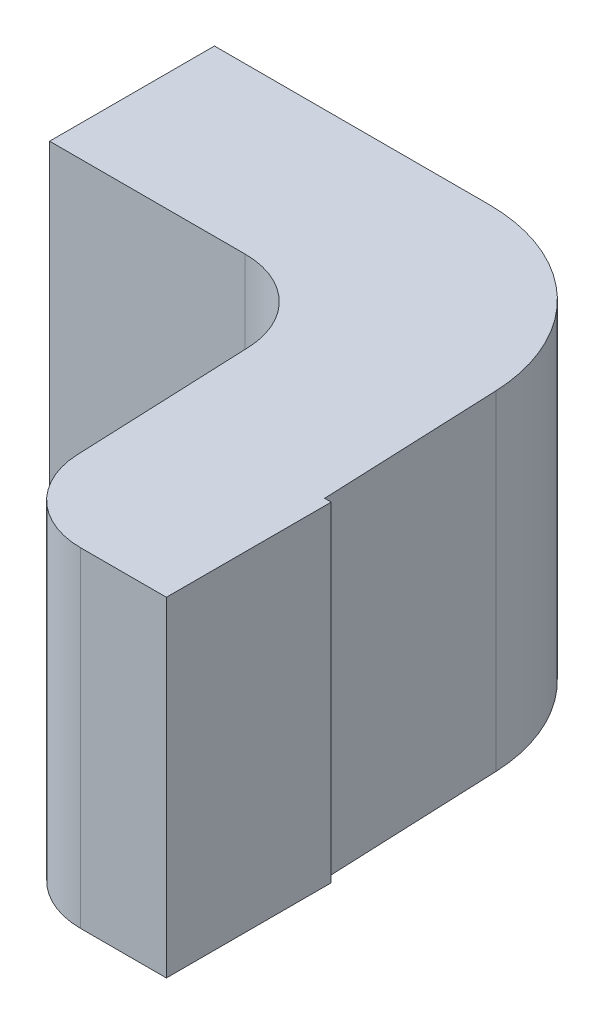
ISO-10303-21;
HEADER;
FILE_DESCRIPTION(('STEP AP214'),'2;1');
FILE_NAME('part.step','',(''),(''),'','','');
FILE_SCHEMA(('AUTOMOTIVE_DESIGN { 1 0 10303 214 1 1 1 1 }'));
ENDSEC;
DATA;
#1=APPLICATION_CONTEXT('core data for automotive mechanical design processes');
#2=APPLICATION_PROTOCOL_DEFINITION('international standard','automotive_design',2000,#1);
#3=PRODUCT_CONTEXT('',#1,'mechanical');
#4=PRODUCT('Part','Part','',(#3));
#5=PRODUCT_RELATED_PRODUCT_CATEGORY('part','',(#4));
#6=PRODUCT_DEFINITION_FORMATION('','',#4);
#7=PRODUCT_DEFINITION_CONTEXT('part definition',#1,'design');
#8=PRODUCT_DEFINITION('design','',#6,#7);
#9=PRODUCT_DEFINITION_SHAPE('','',#8);
#10=(LENGTH_UNIT() NAMED_UNIT(*) SI_UNIT(.MILLI.,.METRE.));
#11=(NAMED_UNIT(*) PLANE_ANGLE_UNIT() SI_UNIT($,.RADIAN.));
#12=(NAMED_UNIT(*) SI_UNIT($,.STERADIAN.) SOLID_ANGLE_UNIT());
#13=UNCERTAINTY_MEASURE_WITH_UNIT(LENGTH_MEASURE(1.E-05),#10,'distance_accuracy_value','');
#14=(GEOMETRIC_REPRESENTATION_CONTEXT(3) GLOBAL_UNCERTAINTY_ASSIGNED_CONTEXT((#13)) GLOBAL_UNIT_ASSIGNED_CONTEXT((#10,
#11,#12)) REPRESENTATION_CONTEXT('',''));
#15=CARTESIAN_POINT('',(0.,0.,0.));
#16=DIRECTION('',(0.,0.,1.));
#17=DIRECTION('',(1.,0.,0.));
#18=AXIS2_PLACEMENT_3D('',#15,#16,#17);
#19=CARTESIAN_POINT('',(-0.869222069455,-1.15,0.246012646141));
#20=DIRECTION('',(0.,-1.,0.));
#21=DIRECTION('',(1.,0.,0.));
#22=AXIS2_PLACEMENT_3D('',#19,#20,#21);
#23=PLANE('',#22);
#24=DIRECTION('',(1.,0.,0.));
#25=VECTOR('',#24,1.);
#26=CARTESIAN_POINT('',(-1.2,-1.15,0.2));
#27=LINE('',#26,#25);
#28=CARTESIAN_POINT('',(-1.2,-1.15,0.2));
#29=VERTEX_POINT('',#28);
#30=CARTESIAN_POINT('',(-0.962760303737,-1.15,0.2));
#31=VERTEX_POINT('',#30);
#32=EDGE_CURVE('E85',#29,#31,#27,.T.);
#33=ORIENTED_EDGE('',*,*,#32,.F.);
#34=DIRECTION('',(0.,0.,-1.));
#35=VECTOR('',#34,1.);
#36=CARTESIAN_POINT('',(-1.2,-1.15,0.));
#37=LINE('',#36,#35);
#38=CARTESIAN_POINT('',(-1.2,-1.15,0.));
#39=VERTEX_POINT('',#38);
#40=EDGE_CURVE('E91',#29,#39,#37,.T.);
#41=ORIENTED_EDGE('',*,*,#40,.T.);
#42=DIRECTION('',(1.,0.,0.));
#43=VECTOR('',#42,1.);
#44=CARTESIAN_POINT('',(-1.2,-1.15,0.));
#45=LINE('',#44,#43);
#46=CARTESIAN_POINT('',(-0.866840202491,-1.15,0.));
#47=VERTEX_POINT('',#46);
#48=EDGE_CURVE('E177',#39,#47,#45,.T.);
#49=ORIENTED_EDGE('',*,*,#48,.T.);
#50=CARTESIAN_POINT('',(-0.866840202491,-1.15,0.2));
#51=DIRECTION('',(0.,1.,0.));
#52=DIRECTION('',(0.,0.,1.));
#53=AXIS2_PLACEMENT_3D('',#50,#51,#52);
#54=CIRCLE('',#53,0.2);
#55=CARTESIAN_POINT('',(-0.667013587872555,-1.15,0.191673891057771));
#56=VERTEX_POINT('',#55);
#57=EDGE_CURVE('E203',#56,#47,#54,.T.);
#58=ORIENTED_EDGE('',*,*,#57,.F.);
#59=DIRECTION('',(-0.0416305447122046,0.,-0.999133073092351));
#60=VECTOR('',#59,1.);
#61=CARTESIAN_POINT('',(-0.675,-1.15,0.));
#62=LINE('',#61,#60);
#63=CARTESIAN_POINT('',(-0.657986412127406,-1.15,0.408326108942011));
#64=VERTEX_POINT('',#63);
#65=EDGE_CURVE('E120',#64,#56,#62,.T.);
#66=ORIENTED_EDGE('',*,*,#65,.F.);
#67=DIRECTION('',(1.,0.,0.));
#68=VECTOR('',#67,1.);
#69=CARTESIAN_POINT('',(-0.849826614618,-1.15,0.408326108942));
#70=LINE('',#69,#68);
#71=CARTESIAN_POINT('',(-0.65,-1.15,0.408326108942));
#72=VERTEX_POINT('',#71);
#73=EDGE_CURVE('E121',#64,#72,#70,.T.);
#74=ORIENTED_EDGE('',*,*,#73,.T.);
#75=DIRECTION('',(0.,0.,-1.));
#76=VECTOR('',#75,1.);
#77=CARTESIAN_POINT('',(-0.65,-1.15,0.408326108942));
#78=LINE('',#77,#76);
#79=CARTESIAN_POINT('',(-0.65,-1.15,0.608326108942));
#80=VERTEX_POINT('',#79);
#81=EDGE_CURVE('E117',#80,#72,#78,.T.);
#82=ORIENTED_EDGE('',*,*,#81,.F.);
#83=DIRECTION('',(1.,0.,0.));
#84=VECTOR('',#83,1.);
#85=CARTESIAN_POINT('',(-0.849826614618,-1.15,0.608326108942));
#86=LINE('',#85,#84);
#87=CARTESIAN_POINT('',(-0.753906513373,-1.15,0.608326108942));
#88=VERTEX_POINT('',#87);
#89=EDGE_CURVE('E150',#88,#80,#86,.T.);
#90=ORIENTED_EDGE('',*,*,#89,.F.);
#91=CARTESIAN_POINT('',(-0.753906513373,-1.15,0.508326108942));
#92=DIRECTION('',(0.,1.,0.));
#93=DIRECTION('',(0.,0.,1.));
#94=AXIS2_PLACEMENT_3D('',#91,#92,#93);
#95=CIRCLE('',#94,0.1);
#96=CARTESIAN_POINT('',(-0.853819820681954,-1.15,0.512489163413604));
#97=VERTEX_POINT('',#96);
#98=EDGE_CURVE('E154',#97,#88,#95,.T.);
#99=ORIENTED_EDGE('',*,*,#98,.F.);
#100=DIRECTION('',(-0.0416305447122046,0.,-0.999133073092351));
#101=VECTOR('',#100,1.);
#102=CARTESIAN_POINT('',(-0.874826614618,-1.15,0.008326108942436));
#103=LINE('',#102,#101);
#104=CARTESIAN_POINT('',(-0.862846996426892,-1.15,0.295836945528869));
#105=VERTEX_POINT('',#104);
#106=EDGE_CURVE('E78',#97,#105,#103,.T.);
#107=ORIENTED_EDGE('',*,*,#106,.T.);
#108=CARTESIAN_POINT('',(-0.962760303737,-1.15,0.3));
#109=DIRECTION('',(0.,1.,0.));
#110=DIRECTION('',(0.,0.,1.));
#111=AXIS2_PLACEMENT_3D('',#108,#109,#110);
#112=CIRCLE('',#111,0.1);
#113=EDGE_CURVE('E19',#105,#31,#112,.T.);
#114=ORIENTED_EDGE('',*,*,#113,.T.);
#115=EDGE_LOOP('',(#33,#41,#49,#58,#66,#74,#82,#90,#99,#107,#114));
#116=FACE_BOUND('',#115,.T.);
#117=ADVANCED_FACE('F16',(#116),#23,.T.);
#118=CARTESIAN_POINT('',(-1.2,-1.15,0.));
#119=DIRECTION('',(0.,0.,1.));
#120=DIRECTION('',(1.,0.,0.));
#121=AXIS2_PLACEMENT_3D('',#118,#119,#120);
#122=PLANE('',#121);
#123=ORIENTED_EDGE('',*,*,#48,.F.);
#124=DIRECTION('',(0.,1.,0.));
#125=VECTOR('',#124,1.);
#126=CARTESIAN_POINT('',(-1.2,-1.15,0.));
#127=LINE('',#126,#125);
#128=CARTESIAN_POINT('',(-1.2,-0.75,0.));
#129=VERTEX_POINT('',#128);
#130=EDGE_CURVE('E161',#39,#129,#127,.T.);
#131=ORIENTED_EDGE('',*,*,#130,.T.);
#132=DIRECTION('',(-1.,0.,0.));
#133=VECTOR('',#132,1.);
#134=CARTESIAN_POINT('',(-0.869222069455,-0.75,0.));
#135=LINE('',#134,#133);
#136=CARTESIAN_POINT('',(-0.866840202491,-0.75,0.));
#137=VERTEX_POINT('',#136);
#138=EDGE_CURVE('E168',#137,#129,#135,.T.);
#139=ORIENTED_EDGE('',*,*,#138,.F.);
#140=DIRECTION('',(0.,1.,0.));
#141=VECTOR('',#140,1.);
#142=CARTESIAN_POINT('',(-0.866840202491,-1.15,0.));
#143=LINE('',#142,#141);
#144=EDGE_CURVE('E228',#47,#137,#143,.T.);
#145=ORIENTED_EDGE('',*,*,#144,.F.);
#146=EDGE_LOOP('',(#123,#131,#139,#145));
#147=FACE_BOUND('',#146,.T.);
#148=ADVANCED_FACE('F246',(#147),#122,.F.);
#149=CARTESIAN_POINT('',(-1.2,-1.15,0.));
#150=DIRECTION('',(1.,0.,0.));
#151=DIRECTION('',(0.,0.,-1.));
#152=AXIS2_PLACEMENT_3D('',#149,#150,#151);
#153=PLANE('',#152);
#154=DIRECTION('',(0.,0.,1.));
#155=VECTOR('',#154,1.);
#156=CARTESIAN_POINT('',(-1.2,-0.75,0.246012646141));
#157=LINE('',#156,#155);
#158=CARTESIAN_POINT('',(-1.2,-0.75,0.2));
#159=VERTEX_POINT('',#158);
#160=EDGE_CURVE('E164',#129,#159,#157,.T.);
#161=ORIENTED_EDGE('',*,*,#160,.F.);
#162=ORIENTED_EDGE('',*,*,#130,.F.);
#163=ORIENTED_EDGE('',*,*,#40,.F.);
#164=DIRECTION('',(0.,1.,0.));
#165=VECTOR('',#164,1.);
#166=CARTESIAN_POINT('',(-1.2,-1.15,0.2));
#167=LINE('',#166,#165);
#168=EDGE_CURVE('E159',#159,#29,#167,.F.);
#169=ORIENTED_EDGE('',*,*,#168,.F.);
#170=EDGE_LOOP('',(#161,#162,#163,#169));
#171=FACE_BOUND('',#170,.T.);
#172=ADVANCED_FACE('F248',(#171),#153,.F.);
#173=CARTESIAN_POINT('',(-1.2,-1.15,0.2));
#174=DIRECTION('',(0.,0.,1.));
#175=DIRECTION('',(1.,0.,0.));
#176=AXIS2_PLACEMENT_3D('',#173,#174,#175);
#177=PLANE('',#176);
#178=ORIENTED_EDGE('',*,*,#32,.T.);
#179=DIRECTION('',(0.,1.,0.));
#180=VECTOR('',#179,1.);
#181=CARTESIAN_POINT('',(-0.962760303737,-1.15,0.2));
#182=LINE('',#181,#180);
#183=CARTESIAN_POINT('',(-0.962760303737,-0.75,0.2));
#184=VERTEX_POINT('',#183);
#185=EDGE_CURVE('E157',#31,#184,#182,.T.);
#186=ORIENTED_EDGE('',*,*,#185,.T.);
#187=DIRECTION('',(-1.,0.,0.));
#188=VECTOR('',#187,1.);
#189=CARTESIAN_POINT('',(-0.869222069455,-0.75,0.2));
#190=LINE('',#189,#188);
#191=EDGE_CURVE('E167',#159,#184,#190,.F.);
#192=ORIENTED_EDGE('',*,*,#191,.F.);
#193=ORIENTED_EDGE('',*,*,#168,.T.);
#194=EDGE_LOOP('',(#178,#186,#192,#193));
#195=FACE_BOUND('',#194,.T.);
#196=ADVANCED_FACE('F250',(#195),#177,.T.);
#197=CARTESIAN_POINT('',(-0.962760303737,-1.15,0.3));
#198=DIRECTION('',(0.,1.,0.));
#199=DIRECTION('',(0.,0.,1.));
#200=AXIS2_PLACEMENT_3D('',#197,#198,#199);
#201=CYLINDRICAL_SURFACE('',#200,0.1);
#202=DIRECTION('',(0.,1.,0.));
#203=VECTOR('',#202,1.);
#204=CARTESIAN_POINT('',(-0.862846996426887,-1.15,0.295836945528995));
#205=LINE('',#204,#203);
#206=CARTESIAN_POINT('',(-0.862846996426947,-0.75,0.295836945528921));
#207=VERTEX_POINT('',#206);
#208=EDGE_CURVE('E155',#105,#207,#205,.T.);
#209=ORIENTED_EDGE('',*,*,#208,.T.);
#210=CARTESIAN_POINT('',(-0.962760303737,-0.75,0.3));
#211=DIRECTION('',(0.,1.,0.));
#212=DIRECTION('',(0.,0.,1.));
#213=AXIS2_PLACEMENT_3D('',#210,#211,#212);
#214=CIRCLE('',#213,0.1);
#215=EDGE_CURVE('E200',#184,#207,#214,.F.);
#216=ORIENTED_EDGE('',*,*,#215,.F.);
#217=ORIENTED_EDGE('',*,*,#185,.F.);
#218=ORIENTED_EDGE('',*,*,#113,.F.);
#219=EDGE_LOOP('',(#209,#216,#217,#218));
#220=FACE_BOUND('',#219,.T.);
#221=ADVANCED_FACE('F253',(#220),#201,.F.);
#222=CARTESIAN_POINT('',(-0.874826614618,-1.15,0.008326108942436));
#223=DIRECTION('',(0.999133073092351,0.,-0.0416305447122046));
#224=DIRECTION('',(-0.0416305447122046,0.,-0.999133073092351));
#225=AXIS2_PLACEMENT_3D('',#222,#223,#224);
#226=PLANE('',#225);
#227=DIRECTION('',(0.0416305447112224,0.,0.999133073092392));
#228=VECTOR('',#227,1.);
#229=CARTESIAN_POINT('',(-0.862846996427,-0.75,0.295836945529));
#230=LINE('',#229,#228);
#231=CARTESIAN_POINT('',(-0.853819820682119,-0.75,0.512489163413561));
#232=VERTEX_POINT('',#231);
#233=EDGE_CURVE('E199',#207,#232,#230,.T.);
#234=ORIENTED_EDGE('',*,*,#233,.F.);
#235=ORIENTED_EDGE('',*,*,#208,.F.);
#236=ORIENTED_EDGE('',*,*,#106,.F.);
#237=DIRECTION('',(0.,1.,0.));
#238=VECTOR('',#237,1.);
#239=CARTESIAN_POINT('',(-0.853819820682202,-1.15,0.512489163414008));
#240=LINE('',#239,#238);
#241=EDGE_CURVE('E151',#232,#97,#240,.F.);
#242=ORIENTED_EDGE('',*,*,#241,.F.);
#243=EDGE_LOOP('',(#234,#235,#236,#242));
#244=FACE_BOUND('',#243,.T.);
#245=ADVANCED_FACE('F254',(#244),#226,.F.);
#246=CARTESIAN_POINT('',(-0.753906513373,-1.15,0.508326108942));
#247=DIRECTION('',(0.,1.,0.));
#248=DIRECTION('',(0.,0.,1.));
#249=AXIS2_PLACEMENT_3D('',#246,#247,#248);
#250=CYLINDRICAL_SURFACE('',#249,0.1);
#251=CARTESIAN_POINT('',(-0.753906513373,-0.75,0.508326108942));
#252=DIRECTION('',(0.,1.,0.));
#253=DIRECTION('',(0.,0.,1.));
#254=AXIS2_PLACEMENT_3D('',#251,#252,#253);
#255=CIRCLE('',#254,0.1);
#256=CARTESIAN_POINT('',(-0.753906513373,-0.75,0.608326108942));
#257=VERTEX_POINT('',#256);
#258=EDGE_CURVE('E136',#232,#257,#255,.T.);
#259=ORIENTED_EDGE('',*,*,#258,.F.);
#260=ORIENTED_EDGE('',*,*,#241,.T.);
#261=ORIENTED_EDGE('',*,*,#98,.T.);
#262=DIRECTION('',(0.,1.,0.));
#263=VECTOR('',#262,1.);
#264=CARTESIAN_POINT('',(-0.753906513373,-1.15,0.608326108942));
#265=LINE('',#264,#263);
#266=EDGE_CURVE('E147',#257,#88,#265,.F.);
#267=ORIENTED_EDGE('',*,*,#266,.F.);
#268=EDGE_LOOP('',(#259,#260,#261,#267));
#269=FACE_BOUND('',#268,.T.);
#270=ADVANCED_FACE('F208',(#269),#250,.T.);
#271=CARTESIAN_POINT('',(-0.849826614618,-1.15,0.608326108942));
#272=DIRECTION('',(0.,0.,1.));
#273=DIRECTION('',(1.,0.,0.));
#274=AXIS2_PLACEMENT_3D('',#271,#272,#273);
#275=PLANE('',#274);
#276=DIRECTION('',(-1.,0.,0.));
#277=VECTOR('',#276,1.);
#278=CARTESIAN_POINT('',(-0.869222069455,-0.75,0.608326108942));
#279=LINE('',#278,#277);
#280=CARTESIAN_POINT('',(-0.65,-0.75,0.608326108942));
#281=VERTEX_POINT('',#280);
#282=EDGE_CURVE('E134',#257,#281,#279,.F.);
#283=ORIENTED_EDGE('',*,*,#282,.F.);
#284=ORIENTED_EDGE('',*,*,#266,.T.);
#285=ORIENTED_EDGE('',*,*,#89,.T.);
#286=DIRECTION('',(0.,1.,0.));
#287=VECTOR('',#286,1.);
#288=CARTESIAN_POINT('',(-0.65,-1.15,0.608326108942));
#289=LINE('',#288,#287);
#290=EDGE_CURVE('E143',#281,#80,#289,.F.);
#291=ORIENTED_EDGE('',*,*,#290,.F.);
#292=EDGE_LOOP('',(#283,#284,#285,#291));
#293=FACE_BOUND('',#292,.T.);
#294=ADVANCED_FACE('F210',(#293),#275,.T.);
#295=CARTESIAN_POINT('',(-0.65,-1.15,0.408326108942));
#296=DIRECTION('',(1.,0.,0.));
#297=DIRECTION('',(0.,0.,-1.));
#298=AXIS2_PLACEMENT_3D('',#295,#296,#297);
#299=PLANE('',#298);
#300=DIRECTION('',(0.,0.,1.));
#301=VECTOR('',#300,1.);
#302=CARTESIAN_POINT('',(-0.65,-0.75,0.246012646141));
#303=LINE('',#302,#301);
#304=CARTESIAN_POINT('',(-0.65,-0.75,0.408326108942));
#305=VERTEX_POINT('',#304);
#306=EDGE_CURVE('E115',#281,#305,#303,.F.);
#307=ORIENTED_EDGE('',*,*,#306,.F.);
#308=ORIENTED_EDGE('',*,*,#290,.T.);
#309=ORIENTED_EDGE('',*,*,#81,.T.);
#310=DIRECTION('',(0.,1.,0.));
#311=VECTOR('',#310,1.);
#312=CARTESIAN_POINT('',(-0.65,-1.15,0.408326108942));
#313=LINE('',#312,#311);
#314=EDGE_CURVE('E110',#72,#305,#313,.T.);
#315=ORIENTED_EDGE('',*,*,#314,.T.);
#316=EDGE_LOOP('',(#307,#308,#309,#315));
#317=FACE_BOUND('',#316,.T.);
#318=ADVANCED_FACE('F112',(#317),#299,.T.);
#319=CARTESIAN_POINT('',(-0.849826614618,-1.15,0.408326108942));
#320=DIRECTION('',(0.,0.,1.));
#321=DIRECTION('',(1.,0.,0.));
#322=AXIS2_PLACEMENT_3D('',#319,#320,#321);
#323=PLANE('',#322);
#324=ORIENTED_EDGE('',*,*,#73,.F.);
#325=DIRECTION('',(0.,1.,0.));
#326=VECTOR('',#325,1.);
#327=CARTESIAN_POINT('',(-0.657986412127406,-1.15,0.408326108942017));
#328=LINE('',#327,#326);
#329=CARTESIAN_POINT('',(-0.657986412127135,-0.75,0.408326108942006));
#330=VERTEX_POINT('',#329);
#331=EDGE_CURVE('E127',#330,#64,#328,.F.);
#332=ORIENTED_EDGE('',*,*,#331,.F.);
#333=DIRECTION('',(-1.,0.,0.));
#334=VECTOR('',#333,1.);
#335=CARTESIAN_POINT('',(-0.869222069455,-0.75,0.408326108942));
#336=LINE('',#335,#334);
#337=EDGE_CURVE('E124',#305,#330,#336,.T.);
#338=ORIENTED_EDGE('',*,*,#337,.F.);
#339=ORIENTED_EDGE('',*,*,#314,.F.);
#340=EDGE_LOOP('',(#324,#332,#338,#339));
#341=FACE_BOUND('',#340,.T.);
#342=ADVANCED_FACE('F125',(#341),#323,.F.);
#343=CARTESIAN_POINT('',(-0.675,-1.15,0.));
#344=DIRECTION('',(0.999133073092351,0.,-0.0416305447122046));
#345=DIRECTION('',(-0.0416305447122046,0.,-0.999133073092351));
#346=AXIS2_PLACEMENT_3D('',#343,#344,#345);
#347=PLANE('',#346);
#348=DIRECTION('',(-0.0416305447160177,0.,-0.999133073092192));
#349=VECTOR('',#348,1.);
#350=CARTESIAN_POINT('',(-0.657986412127,-0.75,0.408326108942));
#351=LINE('',#350,#349);
#352=CARTESIAN_POINT('',(-0.667013587872781,-0.75,0.191673891057398));
#353=VERTEX_POINT('',#352);
#354=EDGE_CURVE('E25',#330,#353,#351,.T.);
#355=ORIENTED_EDGE('',*,*,#354,.F.);
#356=ORIENTED_EDGE('',*,*,#331,.T.);
#357=ORIENTED_EDGE('',*,*,#65,.T.);
#358=DIRECTION('',(0.,1.,0.));
#359=VECTOR('',#358,1.);
#360=CARTESIAN_POINT('',(-0.667013587872512,-1.15,0.19167389105798));
#361=LINE('',#360,#359);
#362=EDGE_CURVE('E34',#353,#56,#361,.F.);
#363=ORIENTED_EDGE('',*,*,#362,.F.);
#364=EDGE_LOOP('',(#355,#356,#357,#363));
#365=FACE_BOUND('',#364,.T.);
#366=ADVANCED_FACE('F236',(#365),#347,.T.);
#367=CARTESIAN_POINT('',(-0.866840202491,-1.15,0.2));
#368=DIRECTION('',(0.,1.,0.));
#369=DIRECTION('',(0.,0.,1.));
#370=AXIS2_PLACEMENT_3D('',#367,#368,#369);
#371=CYLINDRICAL_SURFACE('',#370,0.2);
#372=ORIENTED_EDGE('',*,*,#362,.T.);
#373=ORIENTED_EDGE('',*,*,#57,.T.);
#374=ORIENTED_EDGE('',*,*,#144,.T.);
#375=CARTESIAN_POINT('',(-0.866840202491,-0.75,0.2));
#376=DIRECTION('',(0.,1.,0.));
#377=DIRECTION('',(0.,0.,1.));
#378=AXIS2_PLACEMENT_3D('',#375,#376,#377);
#379=CIRCLE('',#378,0.2);
#380=EDGE_CURVE('E11',#353,#137,#379,.T.);
#381=ORIENTED_EDGE('',*,*,#380,.F.);
#382=EDGE_LOOP('',(#372,#373,#374,#381));
#383=FACE_BOUND('',#382,.T.);
#384=ADVANCED_FACE('F242',(#383),#371,.T.);
#385=CARTESIAN_POINT('',(-0.869222069455,-0.75,0.246012646141));
#386=DIRECTION('',(0.,1.,0.));
#387=DIRECTION('',(-1.,0.,0.));
#388=AXIS2_PLACEMENT_3D('',#385,#386,#387);
#389=PLANE('',#388);
#390=ORIENTED_EDGE('',*,*,#354,.T.);
#391=ORIENTED_EDGE('',*,*,#380,.T.);
#392=ORIENTED_EDGE('',*,*,#138,.T.);
#393=ORIENTED_EDGE('',*,*,#160,.T.);
#394=ORIENTED_EDGE('',*,*,#191,.T.);
#395=ORIENTED_EDGE('',*,*,#215,.T.);
#396=ORIENTED_EDGE('',*,*,#233,.T.);
#397=ORIENTED_EDGE('',*,*,#258,.T.);
#398=ORIENTED_EDGE('',*,*,#282,.T.);
#399=ORIENTED_EDGE('',*,*,#306,.T.);
#400=ORIENTED_EDGE('',*,*,#337,.T.);
#401=EDGE_LOOP('',(#390,#391,#392,#393,#394,#395,#396,#397,#398,#399,#400));
#402=FACE_BOUND('',#401,.T.);
#403=ADVANCED_FACE('F131',(#402),#389,.T.);
#404=CLOSED_SHELL('',(#117,#148,#172,#196,#221,#245,#270,#294,#318,#342,#366,#384,#403));
#405=MANIFOLD_SOLID_BREP('B1',#404);
#406=ADVANCED_BREP_SHAPE_REPRESENTATION('',(#18,#405),#14);
#407=SHAPE_DEFINITION_REPRESENTATION(#9,#406);
ENDSEC;
END-ISO-10303-21;
